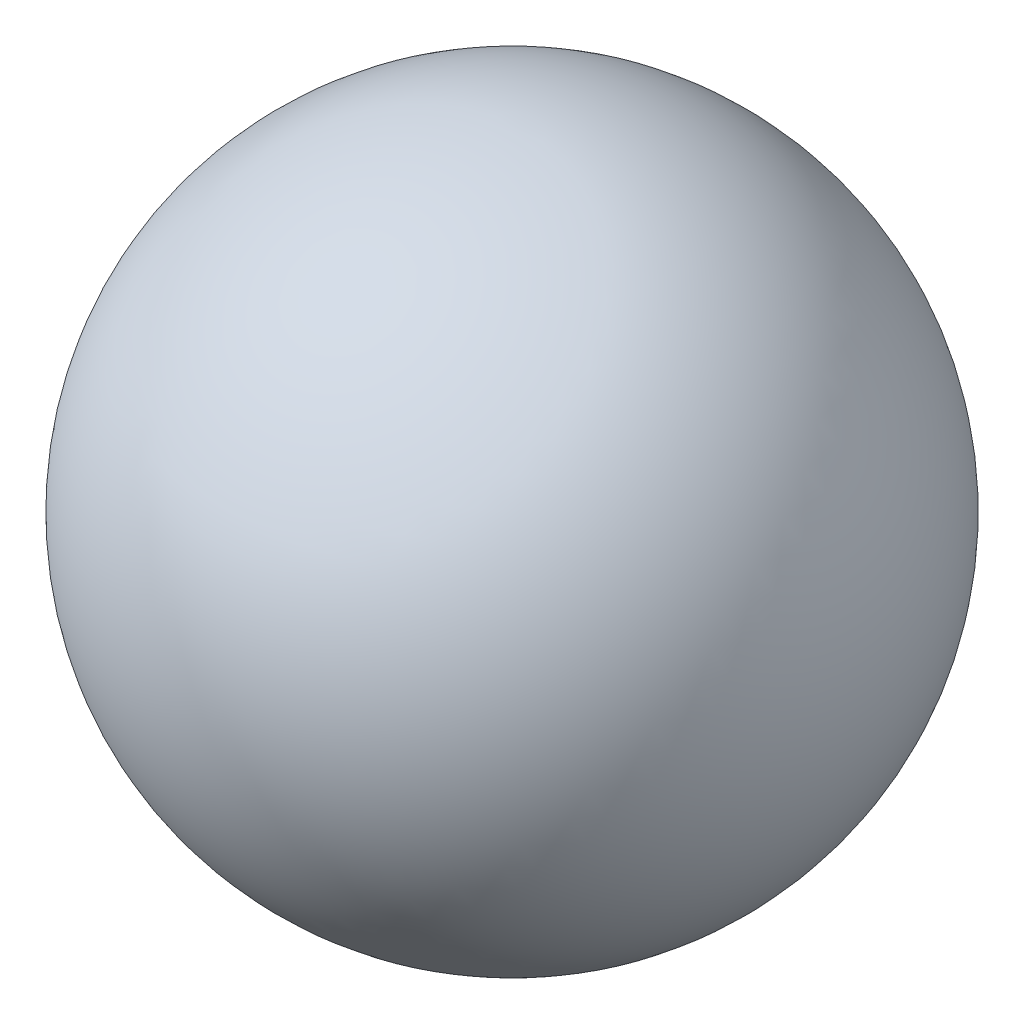
ISO-10303-21;
HEADER;
FILE_DESCRIPTION(('STEP AP214'),'2;1');
FILE_NAME('part.step','',(''),(''),'','','');
FILE_SCHEMA(('AUTOMOTIVE_DESIGN { 1 0 10303 214 1 1 1 1 }'));
ENDSEC;
DATA;
#1=APPLICATION_CONTEXT('core data for automotive mechanical design processes');
#2=APPLICATION_PROTOCOL_DEFINITION('international standard','automotive_design',2000,#1);
#3=PRODUCT_CONTEXT('',#1,'mechanical');
#4=PRODUCT('Part','Part','',(#3));
#5=PRODUCT_RELATED_PRODUCT_CATEGORY('part','',(#4));
#6=PRODUCT_DEFINITION_FORMATION('','',#4);
#7=PRODUCT_DEFINITION_CONTEXT('part definition',#1,'design');
#8=PRODUCT_DEFINITION('design','',#6,#7);
#9=PRODUCT_DEFINITION_SHAPE('','',#8);
#10=(LENGTH_UNIT() NAMED_UNIT(*) SI_UNIT(.MILLI.,.METRE.));
#11=(NAMED_UNIT(*) PLANE_ANGLE_UNIT() SI_UNIT($,.RADIAN.));
#12=(NAMED_UNIT(*) SI_UNIT($,.STERADIAN.) SOLID_ANGLE_UNIT());
#13=UNCERTAINTY_MEASURE_WITH_UNIT(LENGTH_MEASURE(1.E-05),#10,'distance_accuracy_value','');
#14=(GEOMETRIC_REPRESENTATION_CONTEXT(3) GLOBAL_UNCERTAINTY_ASSIGNED_CONTEXT((#13)) GLOBAL_UNIT_ASSIGNED_CONTEXT((#10,
#11,#12)) REPRESENTATION_CONTEXT('',''));
#15=CARTESIAN_POINT('',(0.,0.,0.));
#16=DIRECTION('',(0.,0.,1.));
#17=DIRECTION('',(1.,0.,0.));
#18=AXIS2_PLACEMENT_3D('',#15,#16,#17);
#19=CARTESIAN_POINT('',(0.,0.,0.));
#20=DIRECTION('',(0.,1.,0.));
#21=DIRECTION('',(1.,0.,0.));
#22=AXIS2_PLACEMENT_3D('',#19,#20,#21);
#23=SPHERICAL_SURFACE('',#22,0.0488957159956893);
#24=CARTESIAN_POINT('',(0.,0.0488957159956893,0.));
#25=VERTEX_POINT('',#24);
#26=VERTEX_LOOP('',#25);
#27=FACE_BOUND('',#26,.T.);
#28=ADVANCED_FACE('F29',(#27),#23,.T.);
#29=CLOSED_SHELL('',(#28));
#30=MANIFOLD_SOLID_BREP('B2',#29);
#31=ADVANCED_BREP_SHAPE_REPRESENTATION('',(#18,#30),#14);
#32=SHAPE_DEFINITION_REPRESENTATION(#9,#31);
ENDSEC;
END-ISO-10303-21;
